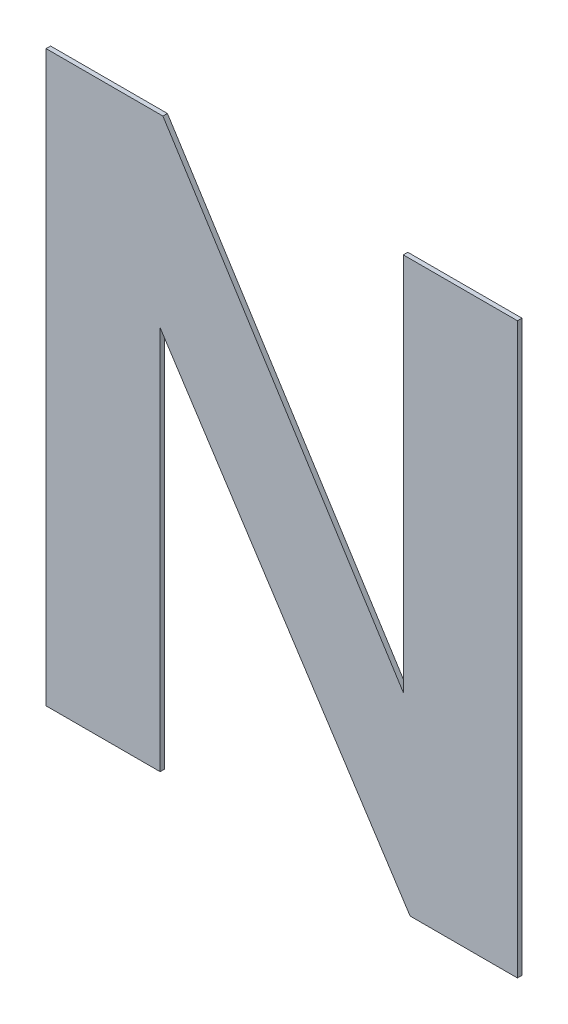
ISO-10303-21;
HEADER;
FILE_DESCRIPTION(('STEP AP214'),'2;1');
FILE_NAME('part.step','',(''),(''),'','','');
FILE_SCHEMA(('AUTOMOTIVE_DESIGN { 1 0 10303 214 1 1 1 1 }'));
ENDSEC;
DATA;
#1=APPLICATION_CONTEXT('core data for automotive mechanical design processes');
#2=APPLICATION_PROTOCOL_DEFINITION('international standard','automotive_design',2000,#1);
#3=PRODUCT_CONTEXT('',#1,'mechanical');
#4=PRODUCT('Part','Part','',(#3));
#5=PRODUCT_RELATED_PRODUCT_CATEGORY('part','',(#4));
#6=PRODUCT_DEFINITION_FORMATION('','',#4);
#7=PRODUCT_DEFINITION_CONTEXT('part definition',#1,'design');
#8=PRODUCT_DEFINITION('design','',#6,#7);
#9=PRODUCT_DEFINITION_SHAPE('','',#8);
#10=(LENGTH_UNIT() NAMED_UNIT(*) SI_UNIT(.MILLI.,.METRE.));
#11=(NAMED_UNIT(*) PLANE_ANGLE_UNIT() SI_UNIT($,.RADIAN.));
#12=(NAMED_UNIT(*) SI_UNIT($,.STERADIAN.) SOLID_ANGLE_UNIT());
#13=UNCERTAINTY_MEASURE_WITH_UNIT(LENGTH_MEASURE(1.E-05),#10,'distance_accuracy_value','');
#14=(GEOMETRIC_REPRESENTATION_CONTEXT(3) GLOBAL_UNCERTAINTY_ASSIGNED_CONTEXT((#13)) GLOBAL_UNIT_ASSIGNED_CONTEXT((#10,
#11,#12)) REPRESENTATION_CONTEXT('',''));
#15=CARTESIAN_POINT('',(0.,0.,0.));
#16=DIRECTION('',(0.,0.,1.));
#17=DIRECTION('',(1.,0.,0.));
#18=AXIS2_PLACEMENT_3D('',#15,#16,#17);
#19=CARTESIAN_POINT('',(-0.628629749372388,0.082451561289846,0.00086146168299));
#20=DIRECTION('',(-0.838429700732409,-0.545009758563792,0.));
#21=DIRECTION('',(0.,0.,1.));
#22=AXIS2_PLACEMENT_3D('',#19,#20,#21);
#23=PLANE('',#22);
#24=DIRECTION('',(0.,0.,1.));
#25=VECTOR('',#24,1.);
#26=CARTESIAN_POINT('',(-0.5953345722493,0.031231074037092,-0.00033853831701));
#27=LINE('',#26,#25);
#28=CARTESIAN_POINT('',(-0.5953345722493,0.031231074037092,-0.00033853831701));
#29=VERTEX_POINT('',#28);
#30=CARTESIAN_POINT('',(-0.5953345722493,0.031231074037092,0.00086146168299));
#31=VERTEX_POINT('',#30);
#32=EDGE_CURVE('E11',#29,#31,#27,.T.);
#33=ORIENTED_EDGE('',*,*,#32,.T.);
#34=DIRECTION('',(-0.545009758563792,0.838429700732409,0.));
#35=VECTOR('',#34,1.);
#36=CARTESIAN_POINT('',(-0.5953345722493,0.031231074037092,0.00086146168299));
#37=LINE('',#36,#35);
#38=CARTESIAN_POINT('',(-0.661924926495476,0.1336720485426,0.00086146168299));
#39=VERTEX_POINT('',#38);
#40=EDGE_CURVE('E24',#31,#39,#37,.T.);
#41=ORIENTED_EDGE('',*,*,#40,.T.);
#42=DIRECTION('',(0.,0.,1.));
#43=VECTOR('',#42,1.);
#44=CARTESIAN_POINT('',(-0.661924926495476,0.1336720485426,-0.00033853831701));
#45=LINE('',#44,#43);
#46=CARTESIAN_POINT('',(-0.661924926495476,0.1336720485426,-0.00033853831701));
#47=VERTEX_POINT('',#46);
#48=EDGE_CURVE('E169',#47,#39,#45,.T.);
#49=ORIENTED_EDGE('',*,*,#48,.F.);
#50=DIRECTION('',(-0.545009758563792,0.838429700732409,0.));
#51=VECTOR('',#50,1.);
#52=CARTESIAN_POINT('',(-0.5953345722493,0.031231074037092,-0.00033853831701));
#53=LINE('',#52,#51);
#54=EDGE_CURVE('E167',#29,#47,#53,.T.);
#55=ORIENTED_EDGE('',*,*,#54,.F.);
#56=EDGE_LOOP('',(#33,#41,#49,#55));
#57=FACE_BOUND('',#56,.T.);
#58=ADVANCED_FACE('F17',(#57),#23,.T.);
#59=CARTESIAN_POINT('',(-0.661924926495476,0.082451561289846,0.00086146168299));
#60=DIRECTION('',(1.,0.,0.));
#61=DIRECTION('',(0.,0.,-1.));
#62=AXIS2_PLACEMENT_3D('',#59,#60,#61);
#63=PLANE('',#62);
#64=ORIENTED_EDGE('',*,*,#48,.T.);
#65=DIRECTION('',(0.,-1.,0.));
#66=VECTOR('',#65,1.);
#67=CARTESIAN_POINT('',(-0.661924926495476,0.1336720485426,0.00086146168299));
#68=LINE('',#67,#66);
#69=CARTESIAN_POINT('',(-0.661924926495476,0.031231074037092,0.00086146168299));
#70=VERTEX_POINT('',#69);
#71=EDGE_CURVE('E165',#39,#70,#68,.T.);
#72=ORIENTED_EDGE('',*,*,#71,.T.);
#73=DIRECTION('',(0.,0.,1.));
#74=VECTOR('',#73,1.);
#75=CARTESIAN_POINT('',(-0.661924926495476,0.031231074037092,-0.00033853831701));
#76=LINE('',#75,#74);
#77=CARTESIAN_POINT('',(-0.661924926495476,0.031231074037092,-0.00033853831701));
#78=VERTEX_POINT('',#77);
#79=EDGE_CURVE('E162',#78,#70,#76,.T.);
#80=ORIENTED_EDGE('',*,*,#79,.F.);
#81=DIRECTION('',(0.,-1.,0.));
#82=VECTOR('',#81,1.);
#83=CARTESIAN_POINT('',(-0.661924926495476,0.1336720485426,-0.00033853831701));
#84=LINE('',#83,#82);
#85=EDGE_CURVE('E159',#47,#78,#84,.T.);
#86=ORIENTED_EDGE('',*,*,#85,.F.);
#87=EDGE_LOOP('',(#64,#72,#80,#86));
#88=FACE_BOUND('',#87,.T.);
#89=ADVANCED_FACE('F175',(#88),#63,.T.);
#90=CARTESIAN_POINT('',(-0.677122479893388,0.031231074037092,0.00086146168299));
#91=DIRECTION('',(0.,-1.,0.));
#92=DIRECTION('',(0.,0.,-1.));
#93=AXIS2_PLACEMENT_3D('',#90,#91,#92);
#94=PLANE('',#93);
#95=ORIENTED_EDGE('',*,*,#79,.T.);
#96=DIRECTION('',(-1.,0.,0.));
#97=VECTOR('',#96,1.);
#98=CARTESIAN_POINT('',(-0.661924926495476,0.031231074037092,0.00086146168299));
#99=LINE('',#98,#97);
#100=CARTESIAN_POINT('',(-0.6923200332913,0.031231074037092,0.00086146168299));
#101=VERTEX_POINT('',#100);
#102=EDGE_CURVE('E157',#70,#101,#99,.T.);
#103=ORIENTED_EDGE('',*,*,#102,.T.);
#104=DIRECTION('',(0.,0.,1.));
#105=VECTOR('',#104,1.);
#106=CARTESIAN_POINT('',(-0.6923200332913,0.031231074037092,-0.00033853831701));
#107=LINE('',#106,#105);
#108=CARTESIAN_POINT('',(-0.6923200332913,0.031231074037092,-0.00033853831701));
#109=VERTEX_POINT('',#108);
#110=EDGE_CURVE('E154',#109,#101,#107,.T.);
#111=ORIENTED_EDGE('',*,*,#110,.F.);
#112=DIRECTION('',(-1.,0.,0.));
#113=VECTOR('',#112,1.);
#114=CARTESIAN_POINT('',(-0.661924926495476,0.031231074037092,-0.00033853831701));
#115=LINE('',#114,#113);
#116=EDGE_CURVE('E151',#78,#109,#115,.T.);
#117=ORIENTED_EDGE('',*,*,#116,.F.);
#118=EDGE_LOOP('',(#95,#103,#111,#117));
#119=FACE_BOUND('',#118,.T.);
#120=ADVANCED_FACE('F181',(#119),#94,.T.);
#121=CARTESIAN_POINT('',(-0.6923200332913,0.107055919785846,0.00086146168299));
#122=DIRECTION('',(-1.,0.,0.));
#123=DIRECTION('',(0.,0.,1.));
#124=AXIS2_PLACEMENT_3D('',#121,#122,#123);
#125=PLANE('',#124);
#126=ORIENTED_EDGE('',*,*,#110,.T.);
#127=DIRECTION('',(0.,1.,0.));
#128=VECTOR('',#127,1.);
#129=CARTESIAN_POINT('',(-0.6923200332913,0.031231074037092,0.00086146168299));
#130=LINE('',#129,#128);
#131=CARTESIAN_POINT('',(-0.6923200332913,0.1828807655346,0.00086146168299));
#132=VERTEX_POINT('',#131);
#133=EDGE_CURVE('E149',#101,#132,#130,.T.);
#134=ORIENTED_EDGE('',*,*,#133,.T.);
#135=DIRECTION('',(0.,0.,1.));
#136=VECTOR('',#135,1.);
#137=CARTESIAN_POINT('',(-0.6923200332913,0.1828807655346,-0.00033853831701));
#138=LINE('',#137,#136);
#139=CARTESIAN_POINT('',(-0.6923200332913,0.1828807655346,-0.00033853831701));
#140=VERTEX_POINT('',#139);
#141=EDGE_CURVE('E146',#140,#132,#138,.T.);
#142=ORIENTED_EDGE('',*,*,#141,.F.);
#143=DIRECTION('',(0.,1.,0.));
#144=VECTOR('',#143,1.);
#145=CARTESIAN_POINT('',(-0.6923200332913,0.031231074037092,-0.00033853831701));
#146=LINE('',#145,#144);
#147=EDGE_CURVE('E143',#109,#140,#146,.T.);
#148=ORIENTED_EDGE('',*,*,#147,.F.);
#149=EDGE_LOOP('',(#126,#134,#142,#148));
#150=FACE_BOUND('',#149,.T.);
#151=ADVANCED_FACE('F185',(#150),#125,.T.);
#152=CARTESIAN_POINT('',(-0.676755455547008,0.1828807655346,0.00086146168299));
#153=DIRECTION('',(0.,1.,0.));
#154=DIRECTION('',(0.,0.,1.));
#155=AXIS2_PLACEMENT_3D('',#152,#153,#154);
#156=PLANE('',#155);
#157=ORIENTED_EDGE('',*,*,#141,.T.);
#158=DIRECTION('',(1.,0.,0.));
#159=VECTOR('',#158,1.);
#160=CARTESIAN_POINT('',(-0.6923200332913,0.1828807655346,0.00086146168299));
#161=LINE('',#160,#159);
#162=CARTESIAN_POINT('',(-0.661190877802716,0.1828807655346,0.00086146168299));
#163=VERTEX_POINT('',#162);
#164=EDGE_CURVE('E141',#132,#163,#161,.T.);
#165=ORIENTED_EDGE('',*,*,#164,.T.);
#166=DIRECTION('',(0.,0.,1.));
#167=VECTOR('',#166,1.);
#168=CARTESIAN_POINT('',(-0.661190877802716,0.1828807655346,-0.00033853831701));
#169=LINE('',#168,#167);
#170=CARTESIAN_POINT('',(-0.661190877802716,0.1828807655346,-0.00033853831701));
#171=VERTEX_POINT('',#170);
#172=EDGE_CURVE('E138',#171,#163,#169,.T.);
#173=ORIENTED_EDGE('',*,*,#172,.F.);
#174=DIRECTION('',(1.,0.,0.));
#175=VECTOR('',#174,1.);
#176=CARTESIAN_POINT('',(-0.6923200332913,0.1828807655346,-0.00033853831701));
#177=LINE('',#176,#175);
#178=EDGE_CURVE('E135',#140,#171,#177,.T.);
#179=ORIENTED_EDGE('',*,*,#178,.F.);
#180=EDGE_LOOP('',(#157,#165,#173,#179));
#181=FACE_BOUND('',#180,.T.);
#182=ADVANCED_FACE('F189',(#181),#156,.T.);
#183=CARTESIAN_POINT('',(-0.629171616025408,0.132395410708,0.00086146168299));
#184=DIRECTION('',(0.844477115493191,0.535591636798316,0.));
#185=DIRECTION('',(0.,0.,-1.));
#186=AXIS2_PLACEMENT_3D('',#183,#184,#185);
#187=PLANE('',#186);
#188=ORIENTED_EDGE('',*,*,#172,.T.);
#189=DIRECTION('',(0.535591636798316,-0.844477115493191,0.));
#190=VECTOR('',#189,1.);
#191=CARTESIAN_POINT('',(-0.661190877802716,0.1828807655346,0.00086146168299));
#192=LINE('',#191,#190);
#193=CARTESIAN_POINT('',(-0.5971523542481,0.0819100558814,0.00086146168299));
#194=VERTEX_POINT('',#193);
#195=EDGE_CURVE('E133',#163,#194,#192,.T.);
#196=ORIENTED_EDGE('',*,*,#195,.T.);
#197=DIRECTION('',(0.,0.,1.));
#198=VECTOR('',#197,1.);
#199=CARTESIAN_POINT('',(-0.5971523542481,0.0819100558814,-0.00033853831701));
#200=LINE('',#199,#198);
#201=CARTESIAN_POINT('',(-0.5971523542481,0.0819100558814,-0.00033853831701));
#202=VERTEX_POINT('',#201);
#203=EDGE_CURVE('E130',#202,#194,#200,.T.);
#204=ORIENTED_EDGE('',*,*,#203,.F.);
#205=DIRECTION('',(0.535591636798316,-0.844477115493191,0.));
#206=VECTOR('',#205,1.);
#207=CARTESIAN_POINT('',(-0.661190877802716,0.1828807655346,-0.00033853831701));
#208=LINE('',#207,#206);
#209=EDGE_CURVE('E127',#171,#202,#208,.T.);
#210=ORIENTED_EDGE('',*,*,#209,.F.);
#211=EDGE_LOOP('',(#188,#196,#204,#210));
#212=FACE_BOUND('',#211,.T.);
#213=ADVANCED_FACE('F192',(#212),#187,.T.);
#214=CARTESIAN_POINT('',(-0.5971523542481,0.132395410708,0.00086146168299));
#215=DIRECTION('',(-1.,0.,0.));
#216=DIRECTION('',(0.,0.,1.));
#217=AXIS2_PLACEMENT_3D('',#214,#215,#216);
#218=PLANE('',#217);
#219=ORIENTED_EDGE('',*,*,#203,.T.);
#220=DIRECTION('',(0.,1.,0.));
#221=VECTOR('',#220,1.);
#222=CARTESIAN_POINT('',(-0.5971523542481,0.0819100558814,0.00086146168299));
#223=LINE('',#222,#221);
#224=CARTESIAN_POINT('',(-0.5971523542481,0.1828807655346,0.00086146168299));
#225=VERTEX_POINT('',#224);
#226=EDGE_CURVE('E125',#194,#225,#223,.T.);
#227=ORIENTED_EDGE('',*,*,#226,.T.);
#228=DIRECTION('',(0.,0.,1.));
#229=VECTOR('',#228,1.);
#230=CARTESIAN_POINT('',(-0.5971523542481,0.1828807655346,-0.00033853831701));
#231=LINE('',#230,#229);
#232=CARTESIAN_POINT('',(-0.5971523542481,0.1828807655346,-0.00033853831701));
#233=VERTEX_POINT('',#232);
#234=EDGE_CURVE('E122',#233,#225,#231,.T.);
#235=ORIENTED_EDGE('',*,*,#234,.F.);
#236=DIRECTION('',(0.,1.,0.));
#237=VECTOR('',#236,1.);
#238=CARTESIAN_POINT('',(-0.5971523542481,0.0819100558814,-0.00033853831701));
#239=LINE('',#238,#237);
#240=EDGE_CURVE('E120',#202,#233,#239,.T.);
#241=ORIENTED_EDGE('',*,*,#240,.F.);
#242=EDGE_LOOP('',(#219,#227,#235,#241));
#243=FACE_BOUND('',#242,.T.);
#244=ADVANCED_FACE('F196',(#243),#218,.T.);
#245=CARTESIAN_POINT('',(-0.5819475759615,0.1828807655346,0.00086146168299));
#246=DIRECTION('',(0.,1.,0.));
#247=DIRECTION('',(0.,0.,1.));
#248=AXIS2_PLACEMENT_3D('',#245,#246,#247);
#249=PLANE('',#248);
#250=ORIENTED_EDGE('',*,*,#234,.T.);
#251=DIRECTION('',(1.,0.,0.));
#252=VECTOR('',#251,1.);
#253=CARTESIAN_POINT('',(-0.5971523542481,0.1828807655346,0.00086146168299));
#254=LINE('',#253,#252);
#255=CARTESIAN_POINT('',(-0.5667427976749,0.1828807655346,0.00086146168299));
#256=VERTEX_POINT('',#255);
#257=EDGE_CURVE('E118',#225,#256,#254,.T.);
#258=ORIENTED_EDGE('',*,*,#257,.T.);
#259=DIRECTION('',(0.,0.,1.));
#260=VECTOR('',#259,1.);
#261=CARTESIAN_POINT('',(-0.5667427976749,0.1828807655346,-0.00033853831701));
#262=LINE('',#261,#260);
#263=CARTESIAN_POINT('',(-0.5667427976749,0.1828807655346,-0.00033853831701));
#264=VERTEX_POINT('',#263);
#265=EDGE_CURVE('E116',#264,#256,#262,.T.);
#266=ORIENTED_EDGE('',*,*,#265,.F.);
#267=DIRECTION('',(1.,0.,0.));
#268=VECTOR('',#267,1.);
#269=CARTESIAN_POINT('',(-0.5971523542481,0.1828807655346,-0.00033853831701));
#270=LINE('',#269,#268);
#271=EDGE_CURVE('E107',#233,#264,#270,.T.);
#272=ORIENTED_EDGE('',*,*,#271,.F.);
#273=EDGE_LOOP('',(#250,#258,#266,#272));
#274=FACE_BOUND('',#273,.T.);
#275=ADVANCED_FACE('F199',(#274),#249,.T.);
#276=CARTESIAN_POINT('',(-0.5667427976749,0.107055919785846,0.00086146168299));
#277=DIRECTION('',(1.,0.,0.));
#278=DIRECTION('',(0.,0.,-1.));
#279=AXIS2_PLACEMENT_3D('',#276,#277,#278);
#280=PLANE('',#279);
#281=ORIENTED_EDGE('',*,*,#265,.T.);
#282=DIRECTION('',(0.,-1.,0.));
#283=VECTOR('',#282,1.);
#284=CARTESIAN_POINT('',(-0.5667427976749,0.1828807655346,0.00086146168299));
#285=LINE('',#284,#283);
#286=CARTESIAN_POINT('',(-0.5667427976749,0.031231074037092,0.00086146168299));
#287=VERTEX_POINT('',#286);
#288=EDGE_CURVE('E96',#256,#287,#285,.T.);
#289=ORIENTED_EDGE('',*,*,#288,.T.);
#290=DIRECTION('',(0.,0.,1.));
#291=VECTOR('',#290,1.);
#292=CARTESIAN_POINT('',(-0.5667427976749,0.031231074037092,-0.00033853831701));
#293=LINE('',#292,#291);
#294=CARTESIAN_POINT('',(-0.5667427976749,0.031231074037092,-0.00033853831701));
#295=VERTEX_POINT('',#294);
#296=EDGE_CURVE('E90',#295,#287,#293,.T.);
#297=ORIENTED_EDGE('',*,*,#296,.F.);
#298=DIRECTION('',(0.,-1.,0.));
#299=VECTOR('',#298,1.);
#300=CARTESIAN_POINT('',(-0.5667427976749,0.1828807655346,-0.00033853831701));
#301=LINE('',#300,#299);
#302=EDGE_CURVE('E94',#264,#295,#301,.T.);
#303=ORIENTED_EDGE('',*,*,#302,.F.);
#304=EDGE_LOOP('',(#281,#289,#297,#303));
#305=FACE_BOUND('',#304,.T.);
#306=ADVANCED_FACE('F93',(#305),#280,.T.);
#307=CARTESIAN_POINT('',(-0.5810386849621,0.031231074037092,0.00086146168299));
#308=DIRECTION('',(0.,-1.,0.));
#309=DIRECTION('',(0.,0.,-1.));
#310=AXIS2_PLACEMENT_3D('',#307,#308,#309);
#311=PLANE('',#310);
#312=ORIENTED_EDGE('',*,*,#296,.T.);
#313=DIRECTION('',(-1.,0.,0.));
#314=VECTOR('',#313,1.);
#315=CARTESIAN_POINT('',(-0.5667427976749,0.031231074037092,0.00086146168299));
#316=LINE('',#315,#314);
#317=EDGE_CURVE('E108',#287,#31,#316,.T.);
#318=ORIENTED_EDGE('',*,*,#317,.T.);
#319=ORIENTED_EDGE('',*,*,#32,.F.);
#320=DIRECTION('',(-1.,0.,0.));
#321=VECTOR('',#320,1.);
#322=CARTESIAN_POINT('',(-0.5667427976749,0.031231074037092,-0.00033853831701));
#323=LINE('',#322,#321);
#324=EDGE_CURVE('E104',#295,#29,#323,.T.);
#325=ORIENTED_EDGE('',*,*,#324,.F.);
#326=EDGE_LOOP('',(#312,#318,#319,#325));
#327=FACE_BOUND('',#326,.T.);
#328=ADVANCED_FACE('F110',(#327),#311,.T.);
#329=CARTESIAN_POINT('',(-0.6295314154831,0.031231074037092,-0.00033853831701));
#330=DIRECTION('',(0.,0.,1.));
#331=DIRECTION('',(1.,0.,0.));
#332=AXIS2_PLACEMENT_3D('',#329,#330,#331);
#333=PLANE('',#332);
#334=ORIENTED_EDGE('',*,*,#54,.T.);
#335=ORIENTED_EDGE('',*,*,#85,.T.);
#336=ORIENTED_EDGE('',*,*,#116,.T.);
#337=ORIENTED_EDGE('',*,*,#147,.T.);
#338=ORIENTED_EDGE('',*,*,#178,.T.);
#339=ORIENTED_EDGE('',*,*,#209,.T.);
#340=ORIENTED_EDGE('',*,*,#240,.T.);
#341=ORIENTED_EDGE('',*,*,#271,.T.);
#342=ORIENTED_EDGE('',*,*,#302,.T.);
#343=ORIENTED_EDGE('',*,*,#324,.T.);
#344=EDGE_LOOP('',(#334,#335,#336,#337,#338,#339,#340,#341,#342,#343));
#345=FACE_BOUND('',#344,.T.);
#346=ADVANCED_FACE('F103',(#345),#333,.F.);
#347=CARTESIAN_POINT('',(-0.6295314154831,0.031231074037092,0.00086146168299));
#348=DIRECTION('',(0.,0.,1.));
#349=DIRECTION('',(1.,0.,0.));
#350=AXIS2_PLACEMENT_3D('',#347,#348,#349);
#351=PLANE('',#350);
#352=ORIENTED_EDGE('',*,*,#40,.F.);
#353=ORIENTED_EDGE('',*,*,#317,.F.);
#354=ORIENTED_EDGE('',*,*,#288,.F.);
#355=ORIENTED_EDGE('',*,*,#257,.F.);
#356=ORIENTED_EDGE('',*,*,#226,.F.);
#357=ORIENTED_EDGE('',*,*,#195,.F.);
#358=ORIENTED_EDGE('',*,*,#164,.F.);
#359=ORIENTED_EDGE('',*,*,#133,.F.);
#360=ORIENTED_EDGE('',*,*,#102,.F.);
#361=ORIENTED_EDGE('',*,*,#71,.F.);
#362=EDGE_LOOP('',(#352,#353,#354,#355,#356,#357,#358,#359,#360,#361));
#363=FACE_BOUND('',#362,.T.);
#364=ADVANCED_FACE('F177',(#363),#351,.T.);
#365=CLOSED_SHELL('',(#58,#89,#120,#151,#182,#213,#244,#275,#306,#328,#346,#364));
#366=MANIFOLD_SOLID_BREP('B1',#365);
#367=ADVANCED_BREP_SHAPE_REPRESENTATION('',(#18,#366),#14);
#368=SHAPE_DEFINITION_REPRESENTATION(#9,#367);
ENDSEC;
END-ISO-10303-21;
